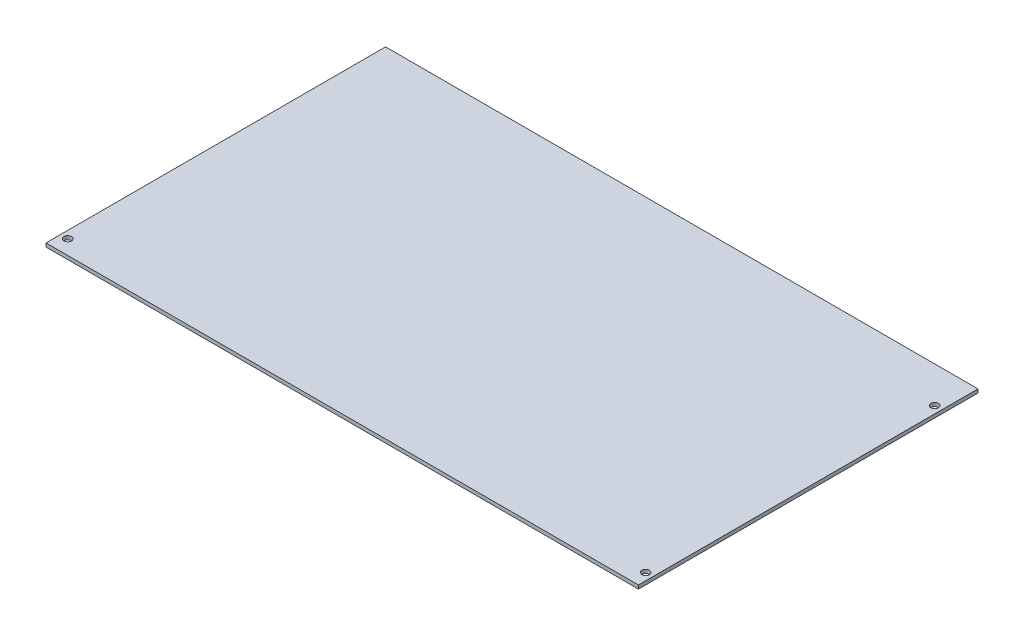
ISO-10303-21;
HEADER;
FILE_DESCRIPTION(('STEP AP214'),'2;1');
FILE_NAME('part.step','',(''),(''),'','','');
FILE_SCHEMA(('AUTOMOTIVE_DESIGN { 1 0 10303 214 1 1 1 1 }'));
ENDSEC;
DATA;
#1=APPLICATION_CONTEXT('core data for automotive mechanical design processes');
#2=APPLICATION_PROTOCOL_DEFINITION('international standard','automotive_design',2000,#1);
#3=PRODUCT_CONTEXT('',#1,'mechanical');
#4=PRODUCT('Part','Part','',(#3));
#5=PRODUCT_RELATED_PRODUCT_CATEGORY('part','',(#4));
#6=PRODUCT_DEFINITION_FORMATION('','',#4);
#7=PRODUCT_DEFINITION_CONTEXT('part definition',#1,'design');
#8=PRODUCT_DEFINITION('design','',#6,#7);
#9=PRODUCT_DEFINITION_SHAPE('','',#8);
#10=(LENGTH_UNIT() NAMED_UNIT(*) SI_UNIT(.MILLI.,.METRE.));
#11=(NAMED_UNIT(*) PLANE_ANGLE_UNIT() SI_UNIT($,.RADIAN.));
#12=(NAMED_UNIT(*) SI_UNIT($,.STERADIAN.) SOLID_ANGLE_UNIT());
#13=UNCERTAINTY_MEASURE_WITH_UNIT(LENGTH_MEASURE(1.E-05),#10,'distance_accuracy_value','');
#14=(GEOMETRIC_REPRESENTATION_CONTEXT(3) GLOBAL_UNCERTAINTY_ASSIGNED_CONTEXT((#13)) GLOBAL_UNIT_ASSIGNED_CONTEXT((#10,
#11,#12)) REPRESENTATION_CONTEXT('',''));
#15=CARTESIAN_POINT('',(0.,0.,0.));
#16=DIRECTION('',(0.,0.,1.));
#17=DIRECTION('',(1.,0.,0.));
#18=AXIS2_PLACEMENT_3D('',#15,#16,#17);
#19=CARTESIAN_POINT('',(0.,3.175,0.));
#20=DIRECTION('',(1.,0.,0.));
#21=DIRECTION('',(0.,0.,-1.));
#22=AXIS2_PLACEMENT_3D('',#19,#20,#21);
#23=PLANE('',#22);
#24=DIRECTION('',(0.,0.,1.));
#25=VECTOR('',#24,1.);
#26=CARTESIAN_POINT('',(0.,0.,0.));
#27=LINE('',#26,#25);
#28=CARTESIAN_POINT('',(0.,0.,-298.45));
#29=VERTEX_POINT('',#28);
#30=CARTESIAN_POINT('',(0.,0.,0.));
#31=VERTEX_POINT('',#30);
#32=EDGE_CURVE('E108',#29,#31,#27,.T.);
#33=ORIENTED_EDGE('',*,*,#32,.T.);
#34=DIRECTION('',(0.,-1.,0.));
#35=VECTOR('',#34,1.);
#36=CARTESIAN_POINT('',(0.,3.175,0.));
#37=LINE('',#36,#35);
#38=CARTESIAN_POINT('',(0.,3.175,0.));
#39=VERTEX_POINT('',#38);
#40=EDGE_CURVE('E11',#39,#31,#37,.T.);
#41=ORIENTED_EDGE('',*,*,#40,.F.);
#42=DIRECTION('',(0.,0.,1.));
#43=VECTOR('',#42,1.);
#44=CARTESIAN_POINT('',(0.,3.175,0.));
#45=LINE('',#44,#43);
#46=CARTESIAN_POINT('',(0.,3.175,-298.45));
#47=VERTEX_POINT('',#46);
#48=EDGE_CURVE('E91',#47,#39,#45,.T.);
#49=ORIENTED_EDGE('',*,*,#48,.F.);
#50=DIRECTION('',(0.,-1.,0.));
#51=VECTOR('',#50,1.);
#52=CARTESIAN_POINT('',(0.,3.175,-298.45));
#53=LINE('',#52,#51);
#54=EDGE_CURVE('E104',#47,#29,#53,.T.);
#55=ORIENTED_EDGE('',*,*,#54,.T.);
#56=EDGE_LOOP('',(#33,#41,#49,#55));
#57=FACE_BOUND('',#56,.T.);
#58=ADVANCED_FACE('F38',(#57),#23,.F.);
#59=CARTESIAN_POINT('',(0.,3.175,0.));
#60=DIRECTION('',(0.,0.,-1.));
#61=DIRECTION('',(-1.,0.,0.));
#62=AXIS2_PLACEMENT_3D('',#59,#60,#61);
#63=PLANE('',#62);
#64=DIRECTION('',(1.,0.,0.));
#65=VECTOR('',#64,1.);
#66=CARTESIAN_POINT('',(0.,0.,0.));
#67=LINE('',#66,#65);
#68=CARTESIAN_POINT('',(520.7,0.,0.));
#69=VERTEX_POINT('',#68);
#70=EDGE_CURVE('E96',#31,#69,#67,.T.);
#71=ORIENTED_EDGE('',*,*,#70,.T.);
#72=DIRECTION('',(0.,-1.,0.));
#73=VECTOR('',#72,1.);
#74=CARTESIAN_POINT('',(520.7,3.175,0.));
#75=LINE('',#74,#73);
#76=CARTESIAN_POINT('',(520.7,3.175,0.));
#77=VERTEX_POINT('',#76);
#78=EDGE_CURVE('E46',#77,#69,#75,.T.);
#79=ORIENTED_EDGE('',*,*,#78,.F.);
#80=DIRECTION('',(1.,0.,0.));
#81=VECTOR('',#80,1.);
#82=CARTESIAN_POINT('',(0.,3.175,0.));
#83=LINE('',#82,#81);
#84=EDGE_CURVE('E85',#39,#77,#83,.T.);
#85=ORIENTED_EDGE('',*,*,#84,.F.);
#86=ORIENTED_EDGE('',*,*,#40,.T.);
#87=EDGE_LOOP('',(#71,#79,#85,#86));
#88=FACE_BOUND('',#87,.T.);
#89=ADVANCED_FACE('F95',(#88),#63,.F.);
#90=CARTESIAN_POINT('',(520.7,3.175,0.));
#91=DIRECTION('',(-1.,0.,0.));
#92=DIRECTION('',(0.,0.,1.));
#93=AXIS2_PLACEMENT_3D('',#90,#91,#92);
#94=PLANE('',#93);
#95=DIRECTION('',(0.,0.,-1.));
#96=VECTOR('',#95,1.);
#97=CARTESIAN_POINT('',(520.7,0.,0.));
#98=LINE('',#97,#96);
#99=CARTESIAN_POINT('',(520.7,0.,-298.45));
#100=VERTEX_POINT('',#99);
#101=EDGE_CURVE('E72',#69,#100,#98,.T.);
#102=ORIENTED_EDGE('',*,*,#101,.T.);
#103=DIRECTION('',(0.,-1.,0.));
#104=VECTOR('',#103,1.);
#105=CARTESIAN_POINT('',(520.7,3.175,-298.45));
#106=LINE('',#105,#104);
#107=CARTESIAN_POINT('',(520.7,3.175,-298.45));
#108=VERTEX_POINT('',#107);
#109=EDGE_CURVE('E98',#108,#100,#106,.T.);
#110=ORIENTED_EDGE('',*,*,#109,.F.);
#111=DIRECTION('',(0.,0.,-1.));
#112=VECTOR('',#111,1.);
#113=CARTESIAN_POINT('',(520.7,3.175,0.));
#114=LINE('',#113,#112);
#115=EDGE_CURVE('E89',#77,#108,#114,.T.);
#116=ORIENTED_EDGE('',*,*,#115,.F.);
#117=ORIENTED_EDGE('',*,*,#78,.T.);
#118=EDGE_LOOP('',(#102,#110,#116,#117));
#119=FACE_BOUND('',#118,.T.);
#120=ADVANCED_FACE('F99',(#119),#94,.F.);
#121=CARTESIAN_POINT('',(0.,3.175,-298.45));
#122=DIRECTION('',(0.,0.,1.));
#123=DIRECTION('',(1.,0.,0.));
#124=AXIS2_PLACEMENT_3D('',#121,#122,#123);
#125=PLANE('',#124);
#126=DIRECTION('',(-1.,0.,0.));
#127=VECTOR('',#126,1.);
#128=CARTESIAN_POINT('',(0.,0.,-298.45));
#129=LINE('',#128,#127);
#130=EDGE_CURVE('E78',#100,#29,#129,.T.);
#131=ORIENTED_EDGE('',*,*,#130,.T.);
#132=ORIENTED_EDGE('',*,*,#54,.F.);
#133=DIRECTION('',(-1.,0.,0.));
#134=VECTOR('',#133,1.);
#135=CARTESIAN_POINT('',(0.,3.175,-298.45));
#136=LINE('',#135,#134);
#137=EDGE_CURVE('E54',#108,#47,#136,.T.);
#138=ORIENTED_EDGE('',*,*,#137,.F.);
#139=ORIENTED_EDGE('',*,*,#109,.T.);
#140=EDGE_LOOP('',(#131,#132,#138,#139));
#141=FACE_BOUND('',#140,.T.);
#142=ADVANCED_FACE('F118',(#141),#125,.F.);
#143=CARTESIAN_POINT('',(0.,3.175,0.));
#144=DIRECTION('',(0.,-1.,0.));
#145=DIRECTION('',(0.,0.,-1.));
#146=AXIS2_PLACEMENT_3D('',#143,#144,#145);
#147=PLANE('',#146);
#148=CARTESIAN_POINT('',(6.34999999999925,3.175,-12.6999999999997));
#149=DIRECTION('',(0.,-1.,0.));
#150=DIRECTION('',(0.,0.,-1.));
#151=AXIS2_PLACEMENT_3D('',#148,#149,#150);
#152=CIRCLE('',#151,3.3528);
#153=CARTESIAN_POINT('',(6.34999999999925,3.175,-16.0527999999997));
#154=VERTEX_POINT('',#153);
#155=EDGE_CURVE('E111',#154,#154,#152,.F.);
#156=ORIENTED_EDGE('',*,*,#155,.F.);
#157=EDGE_LOOP('',(#156));
#158=FACE_BOUND('',#157,.T.);
#159=CARTESIAN_POINT('',(514.349999999998,3.175,-12.6999999999992));
#160=DIRECTION('',(0.,-1.,0.));
#161=DIRECTION('',(0.,0.,-1.));
#162=AXIS2_PLACEMENT_3D('',#159,#160,#161);
#163=CIRCLE('',#162,3.35279999999993);
#164=CARTESIAN_POINT('',(514.349999999998,3.175,-16.0527999999991));
#165=VERTEX_POINT('',#164);
#166=EDGE_CURVE('E131',#165,#165,#163,.F.);
#167=ORIENTED_EDGE('',*,*,#166,.F.);
#168=EDGE_LOOP('',(#167));
#169=FACE_BOUND('',#168,.T.);
#170=CARTESIAN_POINT('',(514.349999999999,3.175,-266.699999999999));
#171=DIRECTION('',(0.,-1.,0.));
#172=DIRECTION('',(0.,0.,-1.));
#173=AXIS2_PLACEMENT_3D('',#170,#171,#172);
#174=CIRCLE('',#173,3.35280000000004);
#175=CARTESIAN_POINT('',(514.349999999999,3.175,-270.052799999999));
#176=VERTEX_POINT('',#175);
#177=EDGE_CURVE('E124',#176,#176,#174,.F.);
#178=ORIENTED_EDGE('',*,*,#177,.F.);
#179=EDGE_LOOP('',(#178));
#180=FACE_BOUND('',#179,.T.);
#181=ORIENTED_EDGE('',*,*,#48,.T.);
#182=ORIENTED_EDGE('',*,*,#84,.T.);
#183=ORIENTED_EDGE('',*,*,#115,.T.);
#184=ORIENTED_EDGE('',*,*,#137,.T.);
#185=EDGE_LOOP('',(#181,#182,#183,#184));
#186=FACE_BOUND('',#185,.T.);
#187=ADVANCED_FACE('F87',(#158,#169,#180,#186),#147,.F.);
#188=CARTESIAN_POINT('',(0.,0.,0.));
#189=DIRECTION('',(0.,-1.,0.));
#190=DIRECTION('',(0.,0.,-1.));
#191=AXIS2_PLACEMENT_3D('',#188,#189,#190);
#192=PLANE('',#191);
#193=CARTESIAN_POINT('',(6.34999999999925,0.,-12.6999999999997));
#194=DIRECTION('',(0.,-1.,0.));
#195=DIRECTION('',(0.,0.,-1.));
#196=AXIS2_PLACEMENT_3D('',#193,#194,#195);
#197=CIRCLE('',#196,3.3528);
#198=CARTESIAN_POINT('',(6.34999999999925,0.,-16.0527999999997));
#199=VERTEX_POINT('',#198);
#200=EDGE_CURVE('E135',#199,#199,#197,.T.);
#201=ORIENTED_EDGE('',*,*,#200,.F.);
#202=EDGE_LOOP('',(#201));
#203=FACE_BOUND('',#202,.T.);
#204=CARTESIAN_POINT('',(514.349999999998,0.,-12.6999999999992));
#205=DIRECTION('',(0.,-1.,0.));
#206=DIRECTION('',(0.,0.,-1.));
#207=AXIS2_PLACEMENT_3D('',#204,#205,#206);
#208=CIRCLE('',#207,3.35279999999993);
#209=CARTESIAN_POINT('',(514.349999999998,0.,-16.0527999999991));
#210=VERTEX_POINT('',#209);
#211=EDGE_CURVE('E127',#210,#210,#208,.T.);
#212=ORIENTED_EDGE('',*,*,#211,.F.);
#213=EDGE_LOOP('',(#212));
#214=FACE_BOUND('',#213,.T.);
#215=CARTESIAN_POINT('',(514.349999999999,0.,-266.699999999999));
#216=DIRECTION('',(0.,-1.,0.));
#217=DIRECTION('',(0.,0.,-1.));
#218=AXIS2_PLACEMENT_3D('',#215,#216,#217);
#219=CIRCLE('',#218,3.35280000000004);
#220=CARTESIAN_POINT('',(514.349999999999,0.,-270.052799999999));
#221=VERTEX_POINT('',#220);
#222=EDGE_CURVE('E128',#221,#221,#219,.T.);
#223=ORIENTED_EDGE('',*,*,#222,.F.);
#224=EDGE_LOOP('',(#223));
#225=FACE_BOUND('',#224,.T.);
#226=ORIENTED_EDGE('',*,*,#32,.F.);
#227=ORIENTED_EDGE('',*,*,#130,.F.);
#228=ORIENTED_EDGE('',*,*,#101,.F.);
#229=ORIENTED_EDGE('',*,*,#70,.F.);
#230=EDGE_LOOP('',(#226,#227,#228,#229));
#231=FACE_BOUND('',#230,.T.);
#232=ADVANCED_FACE('F121',(#203,#214,#225,#231),#192,.T.);
#233=CARTESIAN_POINT('',(514.349999999999,3.176,-266.699999999999));
#234=DIRECTION('',(0.,-1.,0.));
#235=DIRECTION('',(0.,0.,-1.));
#236=AXIS2_PLACEMENT_3D('',#233,#234,#235);
#237=CYLINDRICAL_SURFACE('',#236,3.35280000000004);
#238=ORIENTED_EDGE('',*,*,#222,.T.);
#239=EDGE_LOOP('',(#238));
#240=FACE_BOUND('',#239,.T.);
#241=ORIENTED_EDGE('',*,*,#177,.T.);
#242=EDGE_LOOP('',(#241));
#243=FACE_BOUND('',#242,.T.);
#244=ADVANCED_FACE('F149',(#240,#243),#237,.F.);
#245=CARTESIAN_POINT('',(514.349999999998,3.176,-12.6999999999992));
#246=DIRECTION('',(0.,-1.,0.));
#247=DIRECTION('',(0.,0.,-1.));
#248=AXIS2_PLACEMENT_3D('',#245,#246,#247);
#249=CYLINDRICAL_SURFACE('',#248,3.35279999999993);
#250=ORIENTED_EDGE('',*,*,#211,.T.);
#251=EDGE_LOOP('',(#250));
#252=FACE_BOUND('',#251,.T.);
#253=ORIENTED_EDGE('',*,*,#166,.T.);
#254=EDGE_LOOP('',(#253));
#255=FACE_BOUND('',#254,.T.);
#256=ADVANCED_FACE('F157',(#252,#255),#249,.F.);
#257=CARTESIAN_POINT('',(6.34999999999925,3.176,-12.6999999999997));
#258=DIRECTION('',(0.,-1.,0.));
#259=DIRECTION('',(0.,0.,-1.));
#260=AXIS2_PLACEMENT_3D('',#257,#258,#259);
#261=CYLINDRICAL_SURFACE('',#260,3.3528);
#262=ORIENTED_EDGE('',*,*,#200,.T.);
#263=EDGE_LOOP('',(#262));
#264=FACE_BOUND('',#263,.T.);
#265=ORIENTED_EDGE('',*,*,#155,.T.);
#266=EDGE_LOOP('',(#265));
#267=FACE_BOUND('',#266,.T.);
#268=ADVANCED_FACE('F144',(#264,#267),#261,.F.);
#269=CLOSED_SHELL('',(#58,#89,#120,#142,#187,#232,#244,#256,#268));
#270=MANIFOLD_SOLID_BREP('B2',#269);
#271=ADVANCED_BREP_SHAPE_REPRESENTATION('',(#18,#270),#14);
#272=SHAPE_DEFINITION_REPRESENTATION(#9,#271);
ENDSEC;
END-ISO-10303-21;
